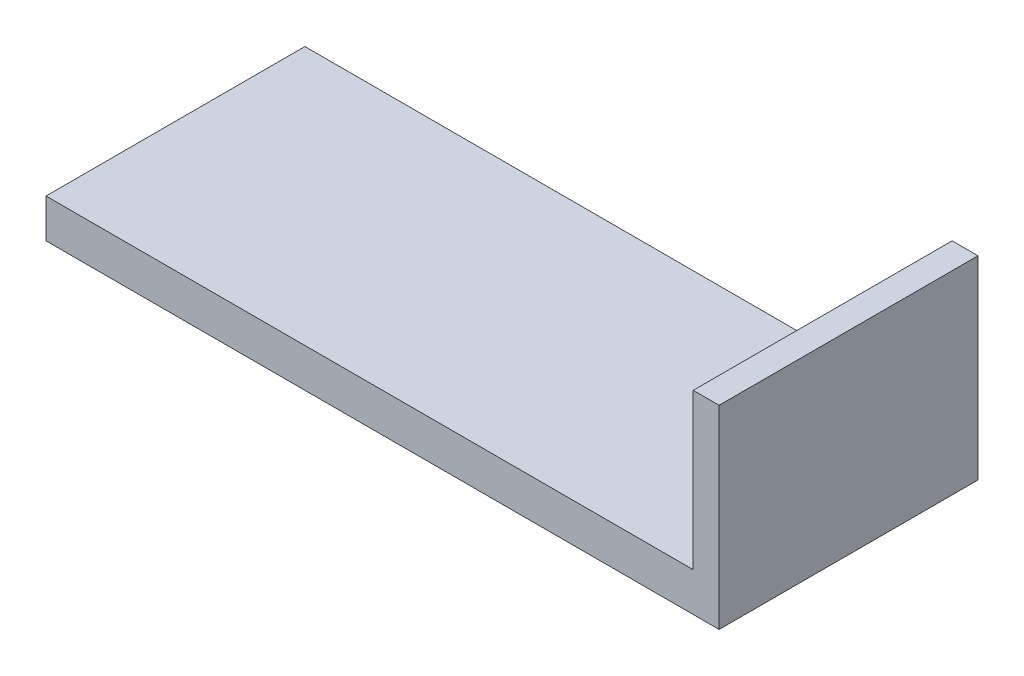
ISO-10303-21;
HEADER;
FILE_DESCRIPTION(('STEP AP214'),'2;1');
FILE_NAME('part.step','',(''),(''),'','','');
FILE_SCHEMA(('AUTOMOTIVE_DESIGN { 1 0 10303 214 1 1 1 1 }'));
ENDSEC;
DATA;
#1=APPLICATION_CONTEXT('core data for automotive mechanical design processes');
#2=APPLICATION_PROTOCOL_DEFINITION('international standard','automotive_design',2000,#1);
#3=PRODUCT_CONTEXT('',#1,'mechanical');
#4=PRODUCT('Part','Part','',(#3));
#5=PRODUCT_RELATED_PRODUCT_CATEGORY('part','',(#4));
#6=PRODUCT_DEFINITION_FORMATION('','',#4);
#7=PRODUCT_DEFINITION_CONTEXT('part definition',#1,'design');
#8=PRODUCT_DEFINITION('design','',#6,#7);
#9=PRODUCT_DEFINITION_SHAPE('','',#8);
#10=(LENGTH_UNIT() NAMED_UNIT(*) SI_UNIT(.MILLI.,.METRE.));
#11=(NAMED_UNIT(*) PLANE_ANGLE_UNIT() SI_UNIT($,.RADIAN.));
#12=(NAMED_UNIT(*) SI_UNIT($,.STERADIAN.) SOLID_ANGLE_UNIT());
#13=UNCERTAINTY_MEASURE_WITH_UNIT(LENGTH_MEASURE(1.E-05),#10,'distance_accuracy_value','');
#14=(GEOMETRIC_REPRESENTATION_CONTEXT(3) GLOBAL_UNCERTAINTY_ASSIGNED_CONTEXT((#13)) GLOBAL_UNIT_ASSIGNED_CONTEXT((#10,
#11,#12)) REPRESENTATION_CONTEXT('',''));
#15=CARTESIAN_POINT('',(0.,0.,0.));
#16=DIRECTION('',(0.,0.,1.));
#17=DIRECTION('',(1.,0.,0.));
#18=AXIS2_PLACEMENT_3D('',#15,#16,#17);
#19=CARTESIAN_POINT('',(0.,-300.,2000.));
#20=DIRECTION('',(1.,0.,0.));
#21=DIRECTION('',(0.,0.,-1.));
#22=AXIS2_PLACEMENT_3D('',#19,#20,#21);
#23=PLANE('',#22);
#24=DIRECTION('',(0.,-1.,0.));
#25=VECTOR('',#24,1.);
#26=CARTESIAN_POINT('',(0.,-300.,0.));
#27=LINE('',#26,#25);
#28=CARTESIAN_POINT('',(0.,0.,0.));
#29=VERTEX_POINT('',#28);
#30=CARTESIAN_POINT('',(0.,-300.,0.));
#31=VERTEX_POINT('',#30);
#32=EDGE_CURVE('E117',#29,#31,#27,.T.);
#33=ORIENTED_EDGE('',*,*,#32,.T.);
#34=DIRECTION('',(0.,0.,-1.));
#35=VECTOR('',#34,1.);
#36=CARTESIAN_POINT('',(0.,-300.,2000.));
#37=LINE('',#36,#35);
#38=CARTESIAN_POINT('',(0.,-300.,2000.));
#39=VERTEX_POINT('',#38);
#40=EDGE_CURVE('E11',#39,#31,#37,.T.);
#41=ORIENTED_EDGE('',*,*,#40,.F.);
#42=DIRECTION('',(0.,-1.,0.));
#43=VECTOR('',#42,1.);
#44=CARTESIAN_POINT('',(0.,-300.,2000.));
#45=LINE('',#44,#43);
#46=CARTESIAN_POINT('',(0.,0.,2000.));
#47=VERTEX_POINT('',#46);
#48=EDGE_CURVE('E127',#47,#39,#45,.T.);
#49=ORIENTED_EDGE('',*,*,#48,.F.);
#50=DIRECTION('',(0.,0.,-1.));
#51=VECTOR('',#50,1.);
#52=CARTESIAN_POINT('',(0.,0.,2000.));
#53=LINE('',#52,#51);
#54=EDGE_CURVE('E113',#47,#29,#53,.T.);
#55=ORIENTED_EDGE('',*,*,#54,.T.);
#56=EDGE_LOOP('',(#33,#41,#49,#55));
#57=FACE_BOUND('',#56,.T.);
#58=ADVANCED_FACE('F33',(#57),#23,.F.);
#59=CARTESIAN_POINT('',(5200.,-299.999999999999,2000.));
#60=DIRECTION('',(0.,1.,0.));
#61=DIRECTION('',(-1.,0.,0.));
#62=AXIS2_PLACEMENT_3D('',#59,#60,#61);
#63=PLANE('',#62);
#64=DIRECTION('',(1.,0.,0.));
#65=VECTOR('',#64,1.);
#66=CARTESIAN_POINT('',(5200.,-299.999999999999,0.));
#67=LINE('',#66,#65);
#68=CARTESIAN_POINT('',(5200.,-299.999999999999,0.));
#69=VERTEX_POINT('',#68);
#70=EDGE_CURVE('E120',#31,#69,#67,.T.);
#71=ORIENTED_EDGE('',*,*,#70,.T.);
#72=DIRECTION('',(0.,0.,-1.));
#73=VECTOR('',#72,1.);
#74=CARTESIAN_POINT('',(5200.,-299.999999999999,2000.));
#75=LINE('',#74,#73);
#76=CARTESIAN_POINT('',(5200.,-299.999999999999,2000.));
#77=VERTEX_POINT('',#76);
#78=EDGE_CURVE('E41',#77,#69,#75,.T.);
#79=ORIENTED_EDGE('',*,*,#78,.F.);
#80=DIRECTION('',(1.,0.,0.));
#81=VECTOR('',#80,1.);
#82=CARTESIAN_POINT('',(5200.,-299.999999999999,2000.));
#83=LINE('',#82,#81);
#84=EDGE_CURVE('E86',#39,#77,#83,.T.);
#85=ORIENTED_EDGE('',*,*,#84,.F.);
#86=ORIENTED_EDGE('',*,*,#40,.T.);
#87=EDGE_LOOP('',(#71,#79,#85,#86));
#88=FACE_BOUND('',#87,.T.);
#89=ADVANCED_FACE('F151',(#88),#63,.F.);
#90=CARTESIAN_POINT('',(5200.,1200.,2000.));
#91=DIRECTION('',(-1.,0.,0.));
#92=DIRECTION('',(0.,0.,1.));
#93=AXIS2_PLACEMENT_3D('',#90,#91,#92);
#94=PLANE('',#93);
#95=DIRECTION('',(0.,1.,0.));
#96=VECTOR('',#95,1.);
#97=CARTESIAN_POINT('',(5200.,1200.,0.));
#98=LINE('',#97,#96);
#99=CARTESIAN_POINT('',(5200.,1200.,0.));
#100=VERTEX_POINT('',#99);
#101=EDGE_CURVE('E122',#69,#100,#98,.T.);
#102=ORIENTED_EDGE('',*,*,#101,.T.);
#103=DIRECTION('',(0.,0.,-1.));
#104=VECTOR('',#103,1.);
#105=CARTESIAN_POINT('',(5200.,1200.,2000.));
#106=LINE('',#105,#104);
#107=CARTESIAN_POINT('',(5200.,1200.,2000.));
#108=VERTEX_POINT('',#107);
#109=EDGE_CURVE('E108',#108,#100,#106,.T.);
#110=ORIENTED_EDGE('',*,*,#109,.F.);
#111=DIRECTION('',(0.,1.,0.));
#112=VECTOR('',#111,1.);
#113=CARTESIAN_POINT('',(5200.,1200.,2000.));
#114=LINE('',#113,#112);
#115=EDGE_CURVE('E99',#77,#108,#114,.T.);
#116=ORIENTED_EDGE('',*,*,#115,.F.);
#117=ORIENTED_EDGE('',*,*,#78,.T.);
#118=EDGE_LOOP('',(#102,#110,#116,#117));
#119=FACE_BOUND('',#118,.T.);
#120=ADVANCED_FACE('F133',(#119),#94,.F.);
#121=CARTESIAN_POINT('',(5000.,1200.,2000.));
#122=DIRECTION('',(0.,-1.,0.));
#123=DIRECTION('',(0.,0.,-1.));
#124=AXIS2_PLACEMENT_3D('',#121,#122,#123);
#125=PLANE('',#124);
#126=DIRECTION('',(-1.,0.,0.));
#127=VECTOR('',#126,1.);
#128=CARTESIAN_POINT('',(5000.,1200.,0.));
#129=LINE('',#128,#127);
#130=CARTESIAN_POINT('',(5000.,1200.,0.));
#131=VERTEX_POINT('',#130);
#132=EDGE_CURVE('E107',#100,#131,#129,.T.);
#133=ORIENTED_EDGE('',*,*,#132,.T.);
#134=DIRECTION('',(0.,0.,-1.));
#135=VECTOR('',#134,1.);
#136=CARTESIAN_POINT('',(5000.,1200.,2000.));
#137=LINE('',#136,#135);
#138=CARTESIAN_POINT('',(5000.,1200.,2000.));
#139=VERTEX_POINT('',#138);
#140=EDGE_CURVE('E104',#139,#131,#137,.T.);
#141=ORIENTED_EDGE('',*,*,#140,.F.);
#142=DIRECTION('',(-1.,0.,0.));
#143=VECTOR('',#142,1.);
#144=CARTESIAN_POINT('',(5000.,1200.,2000.));
#145=LINE('',#144,#143);
#146=EDGE_CURVE('E93',#108,#139,#145,.T.);
#147=ORIENTED_EDGE('',*,*,#146,.F.);
#148=ORIENTED_EDGE('',*,*,#109,.T.);
#149=EDGE_LOOP('',(#133,#141,#147,#148));
#150=FACE_BOUND('',#149,.T.);
#151=ADVANCED_FACE('F105',(#150),#125,.F.);
#152=CARTESIAN_POINT('',(5000.,0.,2000.));
#153=DIRECTION('',(1.,0.,0.));
#154=DIRECTION('',(0.,0.,-1.));
#155=AXIS2_PLACEMENT_3D('',#152,#153,#154);
#156=PLANE('',#155);
#157=DIRECTION('',(0.,-1.,0.));
#158=VECTOR('',#157,1.);
#159=CARTESIAN_POINT('',(5000.,0.,0.));
#160=LINE('',#159,#158);
#161=CARTESIAN_POINT('',(5000.,0.,0.));
#162=VERTEX_POINT('',#161);
#163=EDGE_CURVE('E72',#131,#162,#160,.T.);
#164=ORIENTED_EDGE('',*,*,#163,.T.);
#165=DIRECTION('',(0.,0.,-1.));
#166=VECTOR('',#165,1.);
#167=CARTESIAN_POINT('',(5000.,0.,2000.));
#168=LINE('',#167,#166);
#169=CARTESIAN_POINT('',(5000.,0.,2000.));
#170=VERTEX_POINT('',#169);
#171=EDGE_CURVE('E109',#170,#162,#168,.T.);
#172=ORIENTED_EDGE('',*,*,#171,.F.);
#173=DIRECTION('',(0.,-1.,0.));
#174=VECTOR('',#173,1.);
#175=CARTESIAN_POINT('',(5000.,0.,2000.));
#176=LINE('',#175,#174);
#177=EDGE_CURVE('E97',#139,#170,#176,.T.);
#178=ORIENTED_EDGE('',*,*,#177,.F.);
#179=ORIENTED_EDGE('',*,*,#140,.T.);
#180=EDGE_LOOP('',(#164,#172,#178,#179));
#181=FACE_BOUND('',#180,.T.);
#182=ADVANCED_FACE('F111',(#181),#156,.F.);
#183=CARTESIAN_POINT('',(0.,0.,2000.));
#184=DIRECTION('',(0.,-1.,0.));
#185=DIRECTION('',(0.,0.,-1.));
#186=AXIS2_PLACEMENT_3D('',#183,#184,#185);
#187=PLANE('',#186);
#188=DIRECTION('',(-1.,0.,0.));
#189=VECTOR('',#188,1.);
#190=CARTESIAN_POINT('',(0.,0.,0.));
#191=LINE('',#190,#189);
#192=EDGE_CURVE('E78',#162,#29,#191,.T.);
#193=ORIENTED_EDGE('',*,*,#192,.T.);
#194=ORIENTED_EDGE('',*,*,#54,.F.);
#195=DIRECTION('',(-1.,0.,0.));
#196=VECTOR('',#195,1.);
#197=CARTESIAN_POINT('',(0.,0.,2000.));
#198=LINE('',#197,#196);
#199=EDGE_CURVE('E49',#170,#47,#198,.T.);
#200=ORIENTED_EDGE('',*,*,#199,.F.);
#201=ORIENTED_EDGE('',*,*,#171,.T.);
#202=EDGE_LOOP('',(#193,#194,#200,#201));
#203=FACE_BOUND('',#202,.T.);
#204=ADVANCED_FACE('F140',(#203),#187,.F.);
#205=CARTESIAN_POINT('',(0.,0.,2000.));
#206=DIRECTION('',(0.,0.,-1.));
#207=DIRECTION('',(-1.,0.,0.));
#208=AXIS2_PLACEMENT_3D('',#205,#206,#207);
#209=PLANE('',#208);
#210=ORIENTED_EDGE('',*,*,#48,.T.);
#211=ORIENTED_EDGE('',*,*,#84,.T.);
#212=ORIENTED_EDGE('',*,*,#115,.T.);
#213=ORIENTED_EDGE('',*,*,#146,.T.);
#214=ORIENTED_EDGE('',*,*,#177,.T.);
#215=ORIENTED_EDGE('',*,*,#199,.T.);
#216=EDGE_LOOP('',(#210,#211,#212,#213,#214,#215));
#217=FACE_BOUND('',#216,.T.);
#218=ADVANCED_FACE('F95',(#217),#209,.F.);
#219=CARTESIAN_POINT('',(0.,0.,0.));
#220=DIRECTION('',(0.,0.,-1.));
#221=DIRECTION('',(-1.,0.,0.));
#222=AXIS2_PLACEMENT_3D('',#219,#220,#221);
#223=PLANE('',#222);
#224=ORIENTED_EDGE('',*,*,#32,.F.);
#225=ORIENTED_EDGE('',*,*,#192,.F.);
#226=ORIENTED_EDGE('',*,*,#163,.F.);
#227=ORIENTED_EDGE('',*,*,#132,.F.);
#228=ORIENTED_EDGE('',*,*,#101,.F.);
#229=ORIENTED_EDGE('',*,*,#70,.F.);
#230=EDGE_LOOP('',(#224,#225,#226,#227,#228,#229));
#231=FACE_BOUND('',#230,.T.);
#232=ADVANCED_FACE('F136',(#231),#223,.T.);
#233=CLOSED_SHELL('',(#58,#89,#120,#151,#182,#204,#218,#232));
#234=MANIFOLD_SOLID_BREP('B2',#233);
#235=ADVANCED_BREP_SHAPE_REPRESENTATION('',(#18,#234),#14);
#236=SHAPE_DEFINITION_REPRESENTATION(#9,#235);
ENDSEC;
END-ISO-10303-21;
